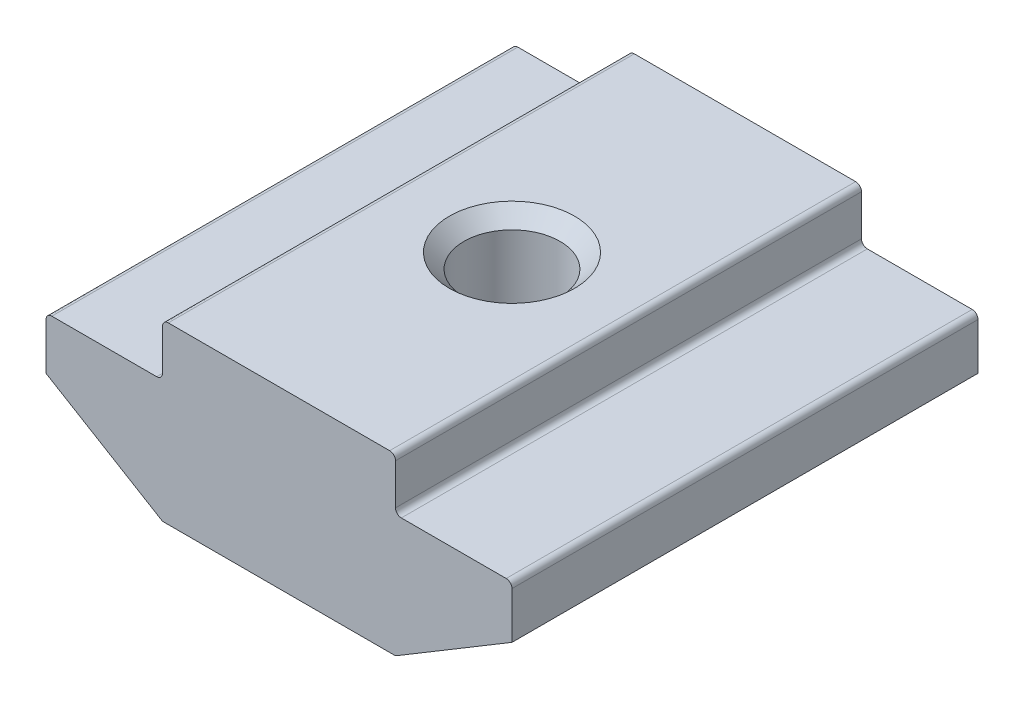
ISO-10303-21;
HEADER;
FILE_DESCRIPTION(('STEP AP214'),'2;1');
FILE_NAME('part.step','',(''),(''),'','','');
FILE_SCHEMA(('AUTOMOTIVE_DESIGN { 1 0 10303 214 1 1 1 1 }'));
ENDSEC;
DATA;
#1=APPLICATION_CONTEXT('core data for automotive mechanical design processes');
#2=APPLICATION_PROTOCOL_DEFINITION('international standard','automotive_design',2000,#1);
#3=PRODUCT_CONTEXT('',#1,'mechanical');
#4=PRODUCT('Part','Part','',(#3));
#5=PRODUCT_RELATED_PRODUCT_CATEGORY('part','',(#4));
#6=PRODUCT_DEFINITION_FORMATION('','',#4);
#7=PRODUCT_DEFINITION_CONTEXT('part definition',#1,'design');
#8=PRODUCT_DEFINITION('design','',#6,#7);
#9=PRODUCT_DEFINITION_SHAPE('','',#8);
#10=(LENGTH_UNIT() NAMED_UNIT(*) SI_UNIT(.MILLI.,.METRE.));
#11=(NAMED_UNIT(*) PLANE_ANGLE_UNIT() SI_UNIT($,.RADIAN.));
#12=(NAMED_UNIT(*) SI_UNIT($,.STERADIAN.) SOLID_ANGLE_UNIT());
#13=UNCERTAINTY_MEASURE_WITH_UNIT(LENGTH_MEASURE(1.E-05),#10,'distance_accuracy_value','');
#14=(GEOMETRIC_REPRESENTATION_CONTEXT(3) GLOBAL_UNCERTAINTY_ASSIGNED_CONTEXT((#13)) GLOBAL_UNIT_ASSIGNED_CONTEXT((#10,
#11,#12)) REPRESENTATION_CONTEXT('',''));
#15=CARTESIAN_POINT('',(0.,0.,0.));
#16=DIRECTION('',(0.,0.,1.));
#17=DIRECTION('',(1.,0.,0.));
#18=AXIS2_PLACEMENT_3D('',#15,#16,#17);
#19=CARTESIAN_POINT('',(-4.,0.,8.));
#20=DIRECTION('',(1.,0.,0.));
#21=DIRECTION('',(0.,0.,-1.));
#22=AXIS2_PLACEMENT_3D('',#19,#20,#21);
#23=PLANE('',#22);
#24=DIRECTION('',(0.,-1.,0.));
#25=VECTOR('',#24,1.);
#26=CARTESIAN_POINT('',(-4.,0.,8.));
#27=LINE('',#26,#25);
#28=CARTESIAN_POINT('',(-4.,-0.200000000000002,8.));
#29=VERTEX_POINT('',#28);
#30=CARTESIAN_POINT('',(-4.,-1.6,8.));
#31=VERTEX_POINT('',#30);
#32=EDGE_CURVE('E234',#29,#31,#27,.T.);
#33=ORIENTED_EDGE('',*,*,#32,.F.);
#34=DIRECTION('',(0.,0.,-1.));
#35=VECTOR('',#34,1.);
#36=CARTESIAN_POINT('',(-4.,-0.200000000000002,8.));
#37=LINE('',#36,#35);
#38=CARTESIAN_POINT('',(-4.,-0.200000000000002,-8.));
#39=VERTEX_POINT('',#38);
#40=EDGE_CURVE('E285',#29,#39,#37,.T.);
#41=ORIENTED_EDGE('',*,*,#40,.T.);
#42=DIRECTION('',(0.,-1.,0.));
#43=VECTOR('',#42,1.);
#44=CARTESIAN_POINT('',(-4.,0.,-8.));
#45=LINE('',#44,#43);
#46=CARTESIAN_POINT('',(-4.,-1.6,-8.));
#47=VERTEX_POINT('',#46);
#48=EDGE_CURVE('E208',#39,#47,#45,.T.);
#49=ORIENTED_EDGE('',*,*,#48,.T.);
#50=DIRECTION('',(0.,0.,-1.));
#51=VECTOR('',#50,1.);
#52=CARTESIAN_POINT('',(-4.,-1.6,8.));
#53=LINE('',#52,#51);
#54=EDGE_CURVE('E283',#47,#31,#53,.F.);
#55=ORIENTED_EDGE('',*,*,#54,.T.);
#56=EDGE_LOOP('',(#33,#41,#49,#55));
#57=FACE_BOUND('',#56,.T.);
#58=ADVANCED_FACE('F37',(#57),#23,.F.);
#59=CARTESIAN_POINT('',(-4.,-1.8,8.));
#60=DIRECTION('',(0.,-1.,0.));
#61=DIRECTION('',(1.,0.,0.));
#62=AXIS2_PLACEMENT_3D('',#59,#60,#61);
#63=PLANE('',#62);
#64=DIRECTION('',(-1.,0.,0.));
#65=VECTOR('',#64,1.);
#66=CARTESIAN_POINT('',(-4.,-1.8,-8.));
#67=LINE('',#66,#65);
#68=CARTESIAN_POINT('',(-4.2,-1.8,-8.));
#69=VERTEX_POINT('',#68);
#70=CARTESIAN_POINT('',(-7.8,-1.8,-8.));
#71=VERTEX_POINT('',#70);
#72=EDGE_CURVE('E211',#69,#71,#67,.T.);
#73=ORIENTED_EDGE('',*,*,#72,.T.);
#74=DIRECTION('',(0.,0.,-1.));
#75=VECTOR('',#74,1.);
#76=CARTESIAN_POINT('',(-7.8,-1.8,8.));
#77=LINE('',#76,#75);
#78=CARTESIAN_POINT('',(-7.8,-1.8,8.));
#79=VERTEX_POINT('',#78);
#80=EDGE_CURVE('E293',#71,#79,#77,.F.);
#81=ORIENTED_EDGE('',*,*,#80,.T.);
#82=DIRECTION('',(-1.,0.,0.));
#83=VECTOR('',#82,1.);
#84=CARTESIAN_POINT('',(-4.,-1.8,8.));
#85=LINE('',#84,#83);
#86=CARTESIAN_POINT('',(-4.2,-1.8,8.));
#87=VERTEX_POINT('',#86);
#88=EDGE_CURVE('E175',#87,#79,#85,.T.);
#89=ORIENTED_EDGE('',*,*,#88,.F.);
#90=DIRECTION('',(0.,0.,-1.));
#91=VECTOR('',#90,1.);
#92=CARTESIAN_POINT('',(-4.2,-1.8,-8.));
#93=LINE('',#92,#91);
#94=EDGE_CURVE('E290',#87,#69,#93,.T.);
#95=ORIENTED_EDGE('',*,*,#94,.T.);
#96=EDGE_LOOP('',(#73,#81,#89,#95));
#97=FACE_BOUND('',#96,.T.);
#98=ADVANCED_FACE('F313',(#97),#63,.F.);
#99=CARTESIAN_POINT('',(-8.,-1.8,8.));
#100=DIRECTION('',(1.,0.,0.));
#101=DIRECTION('',(0.,0.,-1.));
#102=AXIS2_PLACEMENT_3D('',#99,#100,#101);
#103=PLANE('',#102);
#104=DIRECTION('',(0.,-1.,0.));
#105=VECTOR('',#104,1.);
#106=CARTESIAN_POINT('',(-8.,-1.8,8.));
#107=LINE('',#106,#105);
#108=CARTESIAN_POINT('',(-8.,-2.,8.));
#109=VERTEX_POINT('',#108);
#110=CARTESIAN_POINT('',(-8.,-3.6,8.));
#111=VERTEX_POINT('',#110);
#112=EDGE_CURVE('E162',#109,#111,#107,.T.);
#113=ORIENTED_EDGE('',*,*,#112,.F.);
#114=DIRECTION('',(0.,0.,-1.));
#115=VECTOR('',#114,1.);
#116=CARTESIAN_POINT('',(-8.,-2.,8.));
#117=LINE('',#116,#115);
#118=CARTESIAN_POINT('',(-8.,-2.,-8.));
#119=VERTEX_POINT('',#118);
#120=EDGE_CURVE('E288',#109,#119,#117,.T.);
#121=ORIENTED_EDGE('',*,*,#120,.T.);
#122=DIRECTION('',(0.,-1.,0.));
#123=VECTOR('',#122,1.);
#124=CARTESIAN_POINT('',(-8.,-1.8,-8.));
#125=LINE('',#124,#123);
#126=CARTESIAN_POINT('',(-8.,-3.6,-8.));
#127=VERTEX_POINT('',#126);
#128=EDGE_CURVE('E181',#119,#127,#125,.T.);
#129=ORIENTED_EDGE('',*,*,#128,.T.);
#130=DIRECTION('',(0.,0.,-1.));
#131=VECTOR('',#130,1.);
#132=CARTESIAN_POINT('',(-8.,-3.6,8.));
#133=LINE('',#132,#131);
#134=EDGE_CURVE('E178',#111,#127,#133,.T.);
#135=ORIENTED_EDGE('',*,*,#134,.F.);
#136=EDGE_LOOP('',(#113,#121,#129,#135));
#137=FACE_BOUND('',#136,.T.);
#138=ADVANCED_FACE('F179',(#137),#103,.F.);
#139=CARTESIAN_POINT('',(-8.,-3.6,8.));
#140=DIRECTION('',(0.514495755427527,0.857492925712544,0.));
#141=DIRECTION('',(-0.857492925712544,0.514495755427527,0.));
#142=AXIS2_PLACEMENT_3D('',#139,#140,#141);
#143=PLANE('',#142);
#144=DIRECTION('',(0.857492925712544,-0.514495755427527,0.));
#145=VECTOR('',#144,1.);
#146=CARTESIAN_POINT('',(-8.,-3.6,-8.));
#147=LINE('',#146,#145);
#148=CARTESIAN_POINT('',(-4.04750235809582,-5.97149858514251,-8.));
#149=VERTEX_POINT('',#148);
#150=EDGE_CURVE('E216',#127,#149,#147,.T.);
#151=ORIENTED_EDGE('',*,*,#150,.T.);
#152=DIRECTION('',(0.,0.,-1.));
#153=VECTOR('',#152,1.);
#154=CARTESIAN_POINT('',(-4.04750235809582,-5.97149858514251,8.));
#155=LINE('',#154,#153);
#156=CARTESIAN_POINT('',(-4.04750235809582,-5.97149858514251,8.));
#157=VERTEX_POINT('',#156);
#158=EDGE_CURVE('E190',#149,#157,#155,.F.);
#159=ORIENTED_EDGE('',*,*,#158,.T.);
#160=DIRECTION('',(0.857492925712544,-0.514495755427527,0.));
#161=VECTOR('',#160,1.);
#162=CARTESIAN_POINT('',(-8.,-3.6,8.));
#163=LINE('',#162,#161);
#164=EDGE_CURVE('E167',#111,#157,#163,.T.);
#165=ORIENTED_EDGE('',*,*,#164,.F.);
#166=ORIENTED_EDGE('',*,*,#134,.T.);
#167=EDGE_LOOP('',(#151,#159,#165,#166));
#168=FACE_BOUND('',#167,.T.);
#169=ADVANCED_FACE('F188',(#168),#143,.F.);
#170=CARTESIAN_POINT('',(-4.,-6.,8.));
#171=DIRECTION('',(0.,1.,0.));
#172=DIRECTION('',(0.,0.,1.));
#173=AXIS2_PLACEMENT_3D('',#170,#171,#172);
#174=PLANE('',#173);
#175=CARTESIAN_POINT('',(0.,-6.,0.));
#176=DIRECTION('',(0.,1.,0.));
#177=DIRECTION('',(0.,0.,1.));
#178=AXIS2_PLACEMENT_3D('',#175,#176,#177);
#179=CIRCLE('',#178,2.15);
#180=CARTESIAN_POINT('',(0.,-6.,2.15));
#181=VERTEX_POINT('',#180);
#182=EDGE_CURVE('E325',#181,#181,#179,.T.);
#183=ORIENTED_EDGE('',*,*,#182,.T.);
#184=EDGE_LOOP('',(#183));
#185=FACE_BOUND('',#184,.T.);
#186=DIRECTION('',(1.,0.,0.));
#187=VECTOR('',#186,1.);
#188=CARTESIAN_POINT('',(-4.,-6.,-8.));
#189=LINE('',#188,#187);
#190=CARTESIAN_POINT('',(-3.94460320701031,-6.,-8.));
#191=VERTEX_POINT('',#190);
#192=CARTESIAN_POINT('',(3.94460320701031,-6.,-8.));
#193=VERTEX_POINT('',#192);
#194=EDGE_CURVE('E218',#191,#193,#189,.T.);
#195=ORIENTED_EDGE('',*,*,#194,.T.);
#196=DIRECTION('',(0.,0.,-1.));
#197=VECTOR('',#196,1.);
#198=CARTESIAN_POINT('',(3.94460320701031,-6.,8.));
#199=LINE('',#198,#197);
#200=CARTESIAN_POINT('',(3.94460320701031,-6.,8.));
#201=VERTEX_POINT('',#200);
#202=EDGE_CURVE('E254',#193,#201,#199,.F.);
#203=ORIENTED_EDGE('',*,*,#202,.T.);
#204=DIRECTION('',(1.,0.,0.));
#205=VECTOR('',#204,1.);
#206=CARTESIAN_POINT('',(-4.,-6.,8.));
#207=LINE('',#206,#205);
#208=CARTESIAN_POINT('',(-3.94460320701031,-6.,8.));
#209=VERTEX_POINT('',#208);
#210=EDGE_CURVE('E191',#209,#201,#207,.T.);
#211=ORIENTED_EDGE('',*,*,#210,.F.);
#212=DIRECTION('',(0.,0.,-1.));
#213=VECTOR('',#212,1.);
#214=CARTESIAN_POINT('',(-3.94460320701031,-6.,8.));
#215=LINE('',#214,#213);
#216=EDGE_CURVE('E251',#209,#191,#215,.T.);
#217=ORIENTED_EDGE('',*,*,#216,.T.);
#218=EDGE_LOOP('',(#195,#203,#211,#217));
#219=FACE_BOUND('',#218,.T.);
#220=ADVANCED_FACE('F329',(#185,#219),#174,.F.);
#221=CARTESIAN_POINT('',(8.,-3.6,8.));
#222=DIRECTION('',(-0.514495755427527,0.857492925712544,0.));
#223=DIRECTION('',(-0.857492925712544,-0.514495755427527,0.));
#224=AXIS2_PLACEMENT_3D('',#221,#222,#223);
#225=PLANE('',#224);
#226=DIRECTION('',(0.857492925712544,0.514495755427527,0.));
#227=VECTOR('',#226,1.);
#228=CARTESIAN_POINT('',(8.,-3.6,8.));
#229=LINE('',#228,#227);
#230=CARTESIAN_POINT('',(4.04750235809582,-5.97149858514251,8.));
#231=VERTEX_POINT('',#230);
#232=CARTESIAN_POINT('',(8.,-3.6,8.));
#233=VERTEX_POINT('',#232);
#234=EDGE_CURVE('E193',#231,#233,#229,.T.);
#235=ORIENTED_EDGE('',*,*,#234,.F.);
#236=DIRECTION('',(0.,0.,-1.));
#237=VECTOR('',#236,1.);
#238=CARTESIAN_POINT('',(4.04750235809582,-5.97149858514251,8.));
#239=LINE('',#238,#237);
#240=CARTESIAN_POINT('',(4.04750235809582,-5.97149858514251,-8.));
#241=VERTEX_POINT('',#240);
#242=EDGE_CURVE('E185',#231,#241,#239,.T.);
#243=ORIENTED_EDGE('',*,*,#242,.T.);
#244=DIRECTION('',(0.857492925712544,0.514495755427527,0.));
#245=VECTOR('',#244,1.);
#246=CARTESIAN_POINT('',(8.,-3.6,-8.));
#247=LINE('',#246,#245);
#248=CARTESIAN_POINT('',(8.,-3.6,-8.));
#249=VERTEX_POINT('',#248);
#250=EDGE_CURVE('E221',#241,#249,#247,.T.);
#251=ORIENTED_EDGE('',*,*,#250,.T.);
#252=DIRECTION('',(0.,0.,-1.));
#253=VECTOR('',#252,1.);
#254=CARTESIAN_POINT('',(8.,-3.6,8.));
#255=LINE('',#254,#253);
#256=EDGE_CURVE('E186',#233,#249,#255,.T.);
#257=ORIENTED_EDGE('',*,*,#256,.F.);
#258=EDGE_LOOP('',(#235,#243,#251,#257));
#259=FACE_BOUND('',#258,.T.);
#260=ADVANCED_FACE('F385',(#259),#225,.F.);
#261=CARTESIAN_POINT('',(8.,-1.8,8.));
#262=DIRECTION('',(-1.,0.,0.));
#263=DIRECTION('',(0.,0.,1.));
#264=AXIS2_PLACEMENT_3D('',#261,#262,#263);
#265=PLANE('',#264);
#266=DIRECTION('',(0.,1.,0.));
#267=VECTOR('',#266,1.);
#268=CARTESIAN_POINT('',(8.,-1.8,-8.));
#269=LINE('',#268,#267);
#270=CARTESIAN_POINT('',(8.,-2.,-8.));
#271=VERTEX_POINT('',#270);
#272=EDGE_CURVE('E223',#249,#271,#269,.T.);
#273=ORIENTED_EDGE('',*,*,#272,.T.);
#274=DIRECTION('',(0.,0.,-1.));
#275=VECTOR('',#274,1.);
#276=CARTESIAN_POINT('',(8.,-2.,8.));
#277=LINE('',#276,#275);
#278=CARTESIAN_POINT('',(8.,-2.,8.));
#279=VERTEX_POINT('',#278);
#280=EDGE_CURVE('E272',#271,#279,#277,.F.);
#281=ORIENTED_EDGE('',*,*,#280,.T.);
#282=DIRECTION('',(0.,1.,0.));
#283=VECTOR('',#282,1.);
#284=CARTESIAN_POINT('',(8.,-1.8,8.));
#285=LINE('',#284,#283);
#286=EDGE_CURVE('E198',#233,#279,#285,.T.);
#287=ORIENTED_EDGE('',*,*,#286,.F.);
#288=ORIENTED_EDGE('',*,*,#256,.T.);
#289=EDGE_LOOP('',(#273,#281,#287,#288));
#290=FACE_BOUND('',#289,.T.);
#291=ADVANCED_FACE('F380',(#290),#265,.F.);
#292=CARTESIAN_POINT('',(4.,-1.8,8.));
#293=DIRECTION('',(0.,-1.,0.));
#294=DIRECTION('',(1.,0.,0.));
#295=AXIS2_PLACEMENT_3D('',#292,#293,#294);
#296=PLANE('',#295);
#297=DIRECTION('',(-1.,0.,0.));
#298=VECTOR('',#297,1.);
#299=CARTESIAN_POINT('',(4.,-1.8,8.));
#300=LINE('',#299,#298);
#301=CARTESIAN_POINT('',(7.8,-1.8,8.));
#302=VERTEX_POINT('',#301);
#303=CARTESIAN_POINT('',(4.2,-1.8,8.));
#304=VERTEX_POINT('',#303);
#305=EDGE_CURVE('E201',#302,#304,#300,.T.);
#306=ORIENTED_EDGE('',*,*,#305,.F.);
#307=DIRECTION('',(0.,0.,-1.));
#308=VECTOR('',#307,1.);
#309=CARTESIAN_POINT('',(7.8,-1.8,8.));
#310=LINE('',#309,#308);
#311=CARTESIAN_POINT('',(7.8,-1.8,-8.));
#312=VERTEX_POINT('',#311);
#313=EDGE_CURVE('E269',#302,#312,#310,.T.);
#314=ORIENTED_EDGE('',*,*,#313,.T.);
#315=DIRECTION('',(-1.,0.,0.));
#316=VECTOR('',#315,1.);
#317=CARTESIAN_POINT('',(4.,-1.8,-8.));
#318=LINE('',#317,#316);
#319=CARTESIAN_POINT('',(4.2,-1.8,-8.));
#320=VERTEX_POINT('',#319);
#321=EDGE_CURVE('E226',#312,#320,#318,.T.);
#322=ORIENTED_EDGE('',*,*,#321,.T.);
#323=DIRECTION('',(0.,0.,-1.));
#324=VECTOR('',#323,1.);
#325=CARTESIAN_POINT('',(4.2,-1.8,8.));
#326=LINE('',#325,#324);
#327=EDGE_CURVE('E267',#320,#304,#326,.F.);
#328=ORIENTED_EDGE('',*,*,#327,.T.);
#329=EDGE_LOOP('',(#306,#314,#322,#328));
#330=FACE_BOUND('',#329,.T.);
#331=ADVANCED_FACE('F372',(#330),#296,.F.);
#332=CARTESIAN_POINT('',(4.,0.,8.));
#333=DIRECTION('',(-1.,0.,0.));
#334=DIRECTION('',(0.,0.,1.));
#335=AXIS2_PLACEMENT_3D('',#332,#333,#334);
#336=PLANE('',#335);
#337=DIRECTION('',(0.,1.,0.));
#338=VECTOR('',#337,1.);
#339=CARTESIAN_POINT('',(4.,0.,8.));
#340=LINE('',#339,#338);
#341=CARTESIAN_POINT('',(4.,-1.6,8.));
#342=VERTEX_POINT('',#341);
#343=CARTESIAN_POINT('',(4.,-0.199999999999998,8.));
#344=VERTEX_POINT('',#343);
#345=EDGE_CURVE('E204',#342,#344,#340,.T.);
#346=ORIENTED_EDGE('',*,*,#345,.F.);
#347=DIRECTION('',(0.,0.,-1.));
#348=VECTOR('',#347,1.);
#349=CARTESIAN_POINT('',(4.,-1.6,-8.));
#350=LINE('',#349,#348);
#351=CARTESIAN_POINT('',(4.,-1.6,-8.));
#352=VERTEX_POINT('',#351);
#353=EDGE_CURVE('E276',#342,#352,#350,.T.);
#354=ORIENTED_EDGE('',*,*,#353,.T.);
#355=DIRECTION('',(0.,1.,0.));
#356=VECTOR('',#355,1.);
#357=CARTESIAN_POINT('',(4.,0.,-8.));
#358=LINE('',#357,#356);
#359=CARTESIAN_POINT('',(4.,-0.199999999999998,-8.));
#360=VERTEX_POINT('',#359);
#361=EDGE_CURVE('E229',#352,#360,#358,.T.);
#362=ORIENTED_EDGE('',*,*,#361,.T.);
#363=DIRECTION('',(0.,0.,-1.));
#364=VECTOR('',#363,1.);
#365=CARTESIAN_POINT('',(4.,-0.199999999999998,8.));
#366=LINE('',#365,#364);
#367=EDGE_CURVE('E274',#360,#344,#366,.F.);
#368=ORIENTED_EDGE('',*,*,#367,.T.);
#369=EDGE_LOOP('',(#346,#354,#362,#368));
#370=FACE_BOUND('',#369,.T.);
#371=ADVANCED_FACE('F353',(#370),#336,.F.);
#372=CARTESIAN_POINT('',(4.,0.,8.));
#373=DIRECTION('',(0.,-1.,0.));
#374=DIRECTION('',(1.,0.,0.));
#375=AXIS2_PLACEMENT_3D('',#372,#373,#374);
#376=PLANE('',#375);
#377=CARTESIAN_POINT('',(0.,0.,0.));
#378=DIRECTION('',(0.,1.,0.));
#379=DIRECTION('',(0.,0.,1.));
#380=AXIS2_PLACEMENT_3D('',#377,#378,#379);
#381=CIRCLE('',#380,2.15);
#382=CARTESIAN_POINT('',(0.,0.,2.15));
#383=VERTEX_POINT('',#382);
#384=EDGE_CURVE('E322',#383,#383,#381,.T.);
#385=ORIENTED_EDGE('',*,*,#384,.F.);
#386=EDGE_LOOP('',(#385));
#387=FACE_BOUND('',#386,.T.);
#388=DIRECTION('',(-1.,0.,0.));
#389=VECTOR('',#388,1.);
#390=CARTESIAN_POINT('',(4.,0.,8.));
#391=LINE('',#390,#389);
#392=CARTESIAN_POINT('',(3.8,0.,8.));
#393=VERTEX_POINT('',#392);
#394=CARTESIAN_POINT('',(-3.8,0.,8.));
#395=VERTEX_POINT('',#394);
#396=EDGE_CURVE('E206',#393,#395,#391,.T.);
#397=ORIENTED_EDGE('',*,*,#396,.F.);
#398=DIRECTION('',(0.,0.,-1.));
#399=VECTOR('',#398,1.);
#400=CARTESIAN_POINT('',(3.8,0.,8.));
#401=LINE('',#400,#399);
#402=CARTESIAN_POINT('',(3.8,0.,-8.));
#403=VERTEX_POINT('',#402);
#404=EDGE_CURVE('E280',#393,#403,#401,.T.);
#405=ORIENTED_EDGE('',*,*,#404,.T.);
#406=DIRECTION('',(-1.,0.,0.));
#407=VECTOR('',#406,1.);
#408=CARTESIAN_POINT('',(4.,0.,-8.));
#409=LINE('',#408,#407);
#410=CARTESIAN_POINT('',(-3.8,0.,-8.));
#411=VERTEX_POINT('',#410);
#412=EDGE_CURVE('E232',#403,#411,#409,.T.);
#413=ORIENTED_EDGE('',*,*,#412,.T.);
#414=DIRECTION('',(0.,0.,-1.));
#415=VECTOR('',#414,1.);
#416=CARTESIAN_POINT('',(-3.8,0.,8.));
#417=LINE('',#416,#415);
#418=EDGE_CURVE('E52',#411,#395,#417,.F.);
#419=ORIENTED_EDGE('',*,*,#418,.T.);
#420=EDGE_LOOP('',(#397,#405,#413,#419));
#421=FACE_BOUND('',#420,.T.);
#422=ADVANCED_FACE('F351',(#387,#421),#376,.F.);
#423=CARTESIAN_POINT('',(0.,0.,8.));
#424=DIRECTION('',(0.,0.,-1.));
#425=DIRECTION('',(-1.,0.,0.));
#426=AXIS2_PLACEMENT_3D('',#423,#424,#425);
#427=PLANE('',#426);
#428=ORIENTED_EDGE('',*,*,#210,.T.);
#429=CARTESIAN_POINT('',(3.94460320701031,-5.8,8.));
#430=DIRECTION('',(0.,0.,-1.));
#431=DIRECTION('',(-1.,0.,0.));
#432=AXIS2_PLACEMENT_3D('',#429,#430,#431);
#433=CIRCLE('',#432,0.2);
#434=EDGE_CURVE('E264',#201,#231,#433,.F.);
#435=ORIENTED_EDGE('',*,*,#434,.T.);
#436=ORIENTED_EDGE('',*,*,#234,.T.);
#437=ORIENTED_EDGE('',*,*,#286,.T.);
#438=CARTESIAN_POINT('',(7.8,-2.,8.));
#439=DIRECTION('',(0.,0.,-1.));
#440=DIRECTION('',(-1.,0.,0.));
#441=AXIS2_PLACEMENT_3D('',#438,#439,#440);
#442=CIRCLE('',#441,0.2);
#443=EDGE_CURVE('E260',#279,#302,#442,.F.);
#444=ORIENTED_EDGE('',*,*,#443,.T.);
#445=ORIENTED_EDGE('',*,*,#305,.T.);
#446=CARTESIAN_POINT('',(4.2,-1.6,8.));
#447=DIRECTION('',(0.,0.,-1.));
#448=DIRECTION('',(-1.,0.,0.));
#449=AXIS2_PLACEMENT_3D('',#446,#447,#448);
#450=CIRCLE('',#449,0.2);
#451=EDGE_CURVE('E297',#304,#342,#450,.T.);
#452=ORIENTED_EDGE('',*,*,#451,.T.);
#453=ORIENTED_EDGE('',*,*,#345,.T.);
#454=CARTESIAN_POINT('',(3.8,-0.199999999999998,8.));
#455=DIRECTION('',(0.,0.,-1.));
#456=DIRECTION('',(-1.,0.,0.));
#457=AXIS2_PLACEMENT_3D('',#454,#455,#456);
#458=CIRCLE('',#457,0.2);
#459=EDGE_CURVE('E59',#344,#393,#458,.F.);
#460=ORIENTED_EDGE('',*,*,#459,.T.);
#461=ORIENTED_EDGE('',*,*,#396,.T.);
#462=CARTESIAN_POINT('',(-3.8,-0.200000000000002,8.));
#463=DIRECTION('',(0.,0.,-1.));
#464=DIRECTION('',(-1.,0.,0.));
#465=AXIS2_PLACEMENT_3D('',#462,#463,#464);
#466=CIRCLE('',#465,0.2);
#467=EDGE_CURVE('E257',#395,#29,#466,.F.);
#468=ORIENTED_EDGE('',*,*,#467,.T.);
#469=ORIENTED_EDGE('',*,*,#32,.T.);
#470=CARTESIAN_POINT('',(-4.2,-1.6,8.));
#471=DIRECTION('',(0.,0.,-1.));
#472=DIRECTION('',(-1.,0.,0.));
#473=AXIS2_PLACEMENT_3D('',#470,#471,#472);
#474=CIRCLE('',#473,0.2);
#475=EDGE_CURVE('E11',#31,#87,#474,.T.);
#476=ORIENTED_EDGE('',*,*,#475,.T.);
#477=ORIENTED_EDGE('',*,*,#88,.T.);
#478=CARTESIAN_POINT('',(-7.8,-2.,8.));
#479=DIRECTION('',(0.,0.,-1.));
#480=DIRECTION('',(-1.,0.,0.));
#481=AXIS2_PLACEMENT_3D('',#478,#479,#480);
#482=CIRCLE('',#481,0.2);
#483=EDGE_CURVE('E171',#79,#109,#482,.F.);
#484=ORIENTED_EDGE('',*,*,#483,.T.);
#485=ORIENTED_EDGE('',*,*,#112,.T.);
#486=ORIENTED_EDGE('',*,*,#164,.T.);
#487=CARTESIAN_POINT('',(-3.94460320701031,-5.8,8.));
#488=DIRECTION('',(0.,0.,-1.));
#489=DIRECTION('',(-1.,0.,0.));
#490=AXIS2_PLACEMENT_3D('',#487,#488,#489);
#491=CIRCLE('',#490,0.2);
#492=EDGE_CURVE('E262',#157,#209,#491,.F.);
#493=ORIENTED_EDGE('',*,*,#492,.T.);
#494=EDGE_LOOP('',(#428,#435,#436,#437,#444,#445,#452,#453,#460,#461,#468,#469,#476,#477,#484,
#485,#486,#493));
#495=FACE_BOUND('',#494,.T.);
#496=ADVANCED_FACE('F165',(#495),#427,.F.);
#497=CARTESIAN_POINT('',(0.,0.,-8.));
#498=DIRECTION('',(0.,0.,-1.));
#499=DIRECTION('',(-1.,0.,0.));
#500=AXIS2_PLACEMENT_3D('',#497,#498,#499);
#501=PLANE('',#500);
#502=ORIENTED_EDGE('',*,*,#250,.F.);
#503=CARTESIAN_POINT('',(3.94460320701031,-5.8,-8.));
#504=DIRECTION('',(0.,0.,-1.));
#505=DIRECTION('',(-1.,0.,0.));
#506=AXIS2_PLACEMENT_3D('',#503,#504,#505);
#507=CIRCLE('',#506,0.2);
#508=EDGE_CURVE('E249',#241,#193,#507,.T.);
#509=ORIENTED_EDGE('',*,*,#508,.T.);
#510=ORIENTED_EDGE('',*,*,#194,.F.);
#511=CARTESIAN_POINT('',(-3.94460320701031,-5.8,-8.));
#512=DIRECTION('',(0.,0.,-1.));
#513=DIRECTION('',(-1.,0.,0.));
#514=AXIS2_PLACEMENT_3D('',#511,#512,#513);
#515=CIRCLE('',#514,0.2);
#516=EDGE_CURVE('E247',#191,#149,#515,.T.);
#517=ORIENTED_EDGE('',*,*,#516,.T.);
#518=ORIENTED_EDGE('',*,*,#150,.F.);
#519=ORIENTED_EDGE('',*,*,#128,.F.);
#520=CARTESIAN_POINT('',(-7.8,-2.,-8.));
#521=DIRECTION('',(0.,0.,-1.));
#522=DIRECTION('',(-1.,0.,0.));
#523=AXIS2_PLACEMENT_3D('',#520,#521,#522);
#524=CIRCLE('',#523,0.2);
#525=EDGE_CURVE('E239',#119,#71,#524,.T.);
#526=ORIENTED_EDGE('',*,*,#525,.T.);
#527=ORIENTED_EDGE('',*,*,#72,.F.);
#528=CARTESIAN_POINT('',(-4.2,-1.6,-8.));
#529=DIRECTION('',(0.,0.,-1.));
#530=DIRECTION('',(-1.,0.,0.));
#531=AXIS2_PLACEMENT_3D('',#528,#529,#530);
#532=CIRCLE('',#531,0.2);
#533=EDGE_CURVE('E45',#69,#47,#532,.F.);
#534=ORIENTED_EDGE('',*,*,#533,.T.);
#535=ORIENTED_EDGE('',*,*,#48,.F.);
#536=CARTESIAN_POINT('',(-3.8,-0.200000000000002,-8.));
#537=DIRECTION('',(0.,0.,-1.));
#538=DIRECTION('',(-1.,0.,0.));
#539=AXIS2_PLACEMENT_3D('',#536,#537,#538);
#540=CIRCLE('',#539,0.2);
#541=EDGE_CURVE('E241',#39,#411,#540,.T.);
#542=ORIENTED_EDGE('',*,*,#541,.T.);
#543=ORIENTED_EDGE('',*,*,#412,.F.);
#544=CARTESIAN_POINT('',(3.8,-0.199999999999998,-8.));
#545=DIRECTION('',(0.,0.,-1.));
#546=DIRECTION('',(-1.,0.,0.));
#547=AXIS2_PLACEMENT_3D('',#544,#545,#546);
#548=CIRCLE('',#547,0.2);
#549=EDGE_CURVE('E243',#403,#360,#548,.T.);
#550=ORIENTED_EDGE('',*,*,#549,.T.);
#551=ORIENTED_EDGE('',*,*,#361,.F.);
#552=CARTESIAN_POINT('',(4.2,-1.6,-8.));
#553=DIRECTION('',(0.,0.,-1.));
#554=DIRECTION('',(-1.,0.,0.));
#555=AXIS2_PLACEMENT_3D('',#552,#553,#554);
#556=CIRCLE('',#555,0.2);
#557=EDGE_CURVE('E295',#352,#320,#556,.F.);
#558=ORIENTED_EDGE('',*,*,#557,.T.);
#559=ORIENTED_EDGE('',*,*,#321,.F.);
#560=CARTESIAN_POINT('',(7.8,-2.,-8.));
#561=DIRECTION('',(0.,0.,-1.));
#562=DIRECTION('',(-1.,0.,0.));
#563=AXIS2_PLACEMENT_3D('',#560,#561,#562);
#564=CIRCLE('',#563,0.2);
#565=EDGE_CURVE('E245',#312,#271,#564,.T.);
#566=ORIENTED_EDGE('',*,*,#565,.T.);
#567=ORIENTED_EDGE('',*,*,#272,.F.);
#568=EDGE_LOOP('',(#502,#509,#510,#517,#518,#519,#526,#527,#534,#535,#542,#543,#550,#551,#558,
#559,#566,#567));
#569=FACE_BOUND('',#568,.T.);
#570=ADVANCED_FACE('F302',(#569),#501,.T.);
#571=CARTESIAN_POINT('',(0.,-5.5,0.));
#572=DIRECTION('',(0.,-1.,0.));
#573=DIRECTION('',(0.,0.,-1.));
#574=AXIS2_PLACEMENT_3D('',#571,#572,#573);
#575=CONICAL_SURFACE('',#574,1.65,0.785398163397447);
#576=ORIENTED_EDGE('',*,*,#182,.F.);
#577=EDGE_LOOP('',(#576));
#578=FACE_BOUND('',#577,.T.);
#579=CARTESIAN_POINT('',(0.,-5.5,0.));
#580=DIRECTION('',(0.,1.,0.));
#581=DIRECTION('',(0.,0.,1.));
#582=AXIS2_PLACEMENT_3D('',#579,#580,#581);
#583=CIRCLE('',#582,1.65);
#584=CARTESIAN_POINT('',(0.,-5.5,1.65));
#585=VERTEX_POINT('',#584);
#586=EDGE_CURVE('E212',#585,#585,#583,.T.);
#587=ORIENTED_EDGE('',*,*,#586,.T.);
#588=EDGE_LOOP('',(#587));
#589=FACE_BOUND('',#588,.T.);
#590=ADVANCED_FACE('F332',(#578,#589),#575,.F.);
#591=CARTESIAN_POINT('',(0.,0.,0.));
#592=DIRECTION('',(0.,1.,0.));
#593=DIRECTION('',(0.,0.,1.));
#594=AXIS2_PLACEMENT_3D('',#591,#592,#593);
#595=CYLINDRICAL_SURFACE('',#594,1.65);
#596=ORIENTED_EDGE('',*,*,#586,.F.);
#597=EDGE_LOOP('',(#596));
#598=FACE_BOUND('',#597,.T.);
#599=CARTESIAN_POINT('',(0.,-0.5,0.));
#600=DIRECTION('',(0.,1.,0.));
#601=DIRECTION('',(0.,0.,1.));
#602=AXIS2_PLACEMENT_3D('',#599,#600,#601);
#603=CIRCLE('',#602,1.65);
#604=CARTESIAN_POINT('',(0.,-0.5,1.65));
#605=VERTEX_POINT('',#604);
#606=EDGE_CURVE('E319',#605,#605,#603,.T.);
#607=ORIENTED_EDGE('',*,*,#606,.T.);
#608=EDGE_LOOP('',(#607));
#609=FACE_BOUND('',#608,.T.);
#610=ADVANCED_FACE('F335',(#598,#609),#595,.F.);
#611=CARTESIAN_POINT('',(0.,0.,0.));
#612=DIRECTION('',(0.,1.,0.));
#613=DIRECTION('',(0.,0.,1.));
#614=AXIS2_PLACEMENT_3D('',#611,#612,#613);
#615=CONICAL_SURFACE('',#614,2.15,0.785398163397449);
#616=ORIENTED_EDGE('',*,*,#606,.F.);
#617=EDGE_LOOP('',(#616));
#618=FACE_BOUND('',#617,.T.);
#619=ORIENTED_EDGE('',*,*,#384,.T.);
#620=EDGE_LOOP('',(#619));
#621=FACE_BOUND('',#620,.T.);
#622=ADVANCED_FACE('F341',(#618,#621),#615,.F.);
#623=CARTESIAN_POINT('',(3.94460320701031,-5.8,8.));
#624=DIRECTION('',(0.,0.,-1.));
#625=DIRECTION('',(-1.,0.,0.));
#626=AXIS2_PLACEMENT_3D('',#623,#624,#625);
#627=CYLINDRICAL_SURFACE('',#626,0.2);
#628=ORIENTED_EDGE('',*,*,#434,.F.);
#629=ORIENTED_EDGE('',*,*,#202,.F.);
#630=ORIENTED_EDGE('',*,*,#508,.F.);
#631=ORIENTED_EDGE('',*,*,#242,.F.);
#632=EDGE_LOOP('',(#628,#629,#630,#631));
#633=FACE_BOUND('',#632,.T.);
#634=ADVANCED_FACE('F347',(#633),#627,.T.);
#635=CARTESIAN_POINT('',(-3.94460320701031,-5.8,8.));
#636=DIRECTION('',(0.,0.,-1.));
#637=DIRECTION('',(-1.,0.,0.));
#638=AXIS2_PLACEMENT_3D('',#635,#636,#637);
#639=CYLINDRICAL_SURFACE('',#638,0.2);
#640=ORIENTED_EDGE('',*,*,#492,.F.);
#641=ORIENTED_EDGE('',*,*,#158,.F.);
#642=ORIENTED_EDGE('',*,*,#516,.F.);
#643=ORIENTED_EDGE('',*,*,#216,.F.);
#644=EDGE_LOOP('',(#640,#641,#642,#643));
#645=FACE_BOUND('',#644,.T.);
#646=ADVANCED_FACE('F394',(#645),#639,.T.);
#647=CARTESIAN_POINT('',(7.8,-2.,8.));
#648=DIRECTION('',(0.,0.,-1.));
#649=DIRECTION('',(-1.,0.,0.));
#650=AXIS2_PLACEMENT_3D('',#647,#648,#649);
#651=CYLINDRICAL_SURFACE('',#650,0.2);
#652=ORIENTED_EDGE('',*,*,#443,.F.);
#653=ORIENTED_EDGE('',*,*,#280,.F.);
#654=ORIENTED_EDGE('',*,*,#565,.F.);
#655=ORIENTED_EDGE('',*,*,#313,.F.);
#656=EDGE_LOOP('',(#652,#653,#654,#655));
#657=FACE_BOUND('',#656,.T.);
#658=ADVANCED_FACE('F376',(#657),#651,.T.);
#659=CARTESIAN_POINT('',(4.2,-1.6,8.));
#660=DIRECTION('',(0.,0.,1.));
#661=DIRECTION('',(1.,0.,0.));
#662=AXIS2_PLACEMENT_3D('',#659,#660,#661);
#663=CYLINDRICAL_SURFACE('',#662,0.2);
#664=ORIENTED_EDGE('',*,*,#451,.F.);
#665=ORIENTED_EDGE('',*,*,#327,.F.);
#666=ORIENTED_EDGE('',*,*,#557,.F.);
#667=ORIENTED_EDGE('',*,*,#353,.F.);
#668=EDGE_LOOP('',(#664,#665,#666,#667));
#669=FACE_BOUND('',#668,.T.);
#670=ADVANCED_FACE('F367',(#669),#663,.F.);
#671=CARTESIAN_POINT('',(3.8,-0.199999999999998,8.));
#672=DIRECTION('',(0.,0.,-1.));
#673=DIRECTION('',(-1.,0.,0.));
#674=AXIS2_PLACEMENT_3D('',#671,#672,#673);
#675=CYLINDRICAL_SURFACE('',#674,0.2);
#676=ORIENTED_EDGE('',*,*,#459,.F.);
#677=ORIENTED_EDGE('',*,*,#367,.F.);
#678=ORIENTED_EDGE('',*,*,#549,.F.);
#679=ORIENTED_EDGE('',*,*,#404,.F.);
#680=EDGE_LOOP('',(#676,#677,#678,#679));
#681=FACE_BOUND('',#680,.T.);
#682=ADVANCED_FACE('F359',(#681),#675,.T.);
#683=CARTESIAN_POINT('',(-3.8,-0.200000000000002,8.));
#684=DIRECTION('',(0.,0.,-1.));
#685=DIRECTION('',(-1.,0.,0.));
#686=AXIS2_PLACEMENT_3D('',#683,#684,#685);
#687=CYLINDRICAL_SURFACE('',#686,0.2);
#688=ORIENTED_EDGE('',*,*,#467,.F.);
#689=ORIENTED_EDGE('',*,*,#418,.F.);
#690=ORIENTED_EDGE('',*,*,#541,.F.);
#691=ORIENTED_EDGE('',*,*,#40,.F.);
#692=EDGE_LOOP('',(#688,#689,#690,#691));
#693=FACE_BOUND('',#692,.T.);
#694=ADVANCED_FACE('F398',(#693),#687,.T.);
#695=CARTESIAN_POINT('',(-7.8,-2.,8.));
#696=DIRECTION('',(0.,0.,-1.));
#697=DIRECTION('',(-1.,0.,0.));
#698=AXIS2_PLACEMENT_3D('',#695,#696,#697);
#699=CYLINDRICAL_SURFACE('',#698,0.2);
#700=ORIENTED_EDGE('',*,*,#483,.F.);
#701=ORIENTED_EDGE('',*,*,#80,.F.);
#702=ORIENTED_EDGE('',*,*,#525,.F.);
#703=ORIENTED_EDGE('',*,*,#120,.F.);
#704=EDGE_LOOP('',(#700,#701,#702,#703));
#705=FACE_BOUND('',#704,.T.);
#706=ADVANCED_FACE('F396',(#705),#699,.T.);
#707=CARTESIAN_POINT('',(-4.2,-1.6,8.));
#708=DIRECTION('',(0.,0.,1.));
#709=DIRECTION('',(1.,0.,0.));
#710=AXIS2_PLACEMENT_3D('',#707,#708,#709);
#711=CYLINDRICAL_SURFACE('',#710,0.2);
#712=ORIENTED_EDGE('',*,*,#475,.F.);
#713=ORIENTED_EDGE('',*,*,#54,.F.);
#714=ORIENTED_EDGE('',*,*,#533,.F.);
#715=ORIENTED_EDGE('',*,*,#94,.F.);
#716=EDGE_LOOP('',(#712,#713,#714,#715));
#717=FACE_BOUND('',#716,.T.);
#718=ADVANCED_FACE('F39',(#717),#711,.F.);
#719=CLOSED_SHELL('',(#58,#98,#138,#169,#220,#260,#291,#331,#371,#422,#496,#570,#590,#610,#622,
#634,#646,#658,#670,#682,#694,#706,#718));
#720=MANIFOLD_SOLID_BREP('B2',#719);
#721=ADVANCED_BREP_SHAPE_REPRESENTATION('',(#18,#720),#14);
#722=SHAPE_DEFINITION_REPRESENTATION(#9,#721);
ENDSEC;
END-ISO-10303-21;
